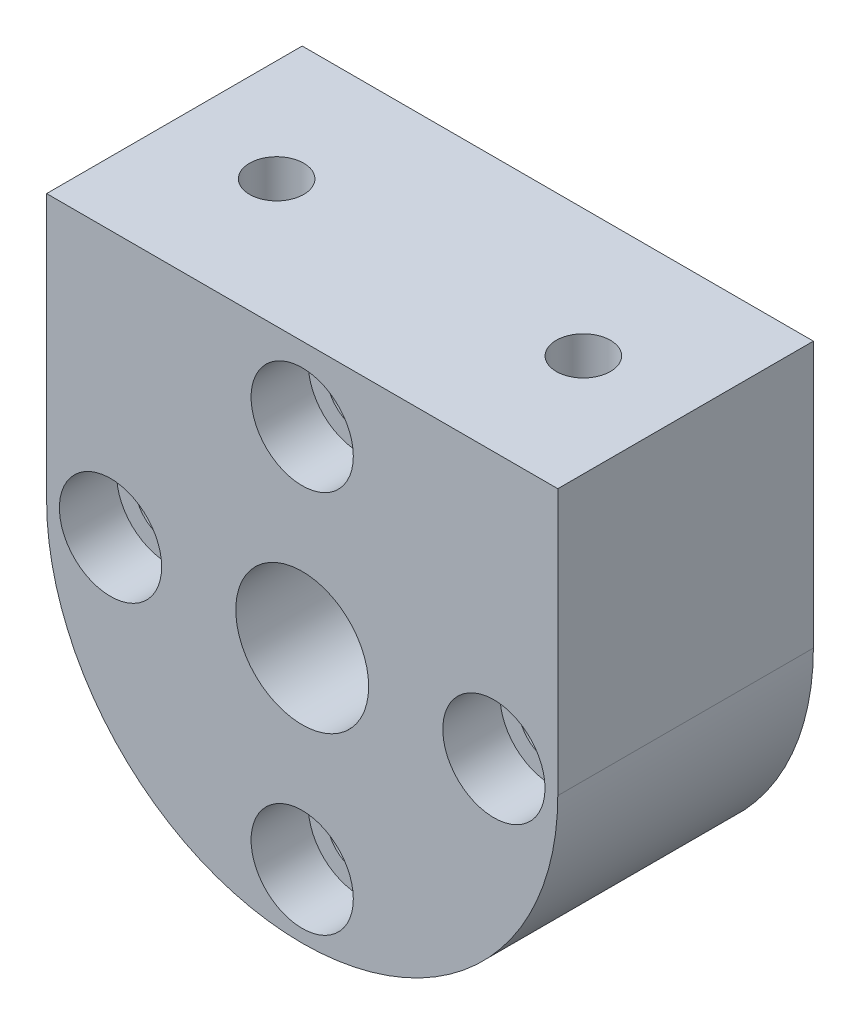
ISO-10303-21;
HEADER;
FILE_DESCRIPTION(('STEP AP214'),'2;1');
FILE_NAME('part.step','',(''),(''),'','','');
FILE_SCHEMA(('AUTOMOTIVE_DESIGN { 1 0 10303 214 1 1 1 1 }'));
ENDSEC;
DATA;
#1=APPLICATION_CONTEXT('core data for automotive mechanical design processes');
#2=APPLICATION_PROTOCOL_DEFINITION('international standard','automotive_design',2000,#1);
#3=PRODUCT_CONTEXT('',#1,'mechanical');
#4=PRODUCT('Part','Part','',(#3));
#5=PRODUCT_RELATED_PRODUCT_CATEGORY('part','',(#4));
#6=PRODUCT_DEFINITION_FORMATION('','',#4);
#7=PRODUCT_DEFINITION_CONTEXT('part definition',#1,'design');
#8=PRODUCT_DEFINITION('design','',#6,#7);
#9=PRODUCT_DEFINITION_SHAPE('','',#8);
#10=(LENGTH_UNIT() NAMED_UNIT(*) SI_UNIT(.MILLI.,.METRE.));
#11=(NAMED_UNIT(*) PLANE_ANGLE_UNIT() SI_UNIT($,.RADIAN.));
#12=(NAMED_UNIT(*) SI_UNIT($,.STERADIAN.) SOLID_ANGLE_UNIT());
#13=UNCERTAINTY_MEASURE_WITH_UNIT(LENGTH_MEASURE(1.E-05),#10,'distance_accuracy_value','');
#14=(GEOMETRIC_REPRESENTATION_CONTEXT(3) GLOBAL_UNCERTAINTY_ASSIGNED_CONTEXT((#13)) GLOBAL_UNIT_ASSIGNED_CONTEXT((#10,
#11,#12)) REPRESENTATION_CONTEXT('',''));
#15=CARTESIAN_POINT('',(0.,0.,0.));
#16=DIRECTION('',(0.,0.,1.));
#17=DIRECTION('',(1.,0.,0.));
#18=AXIS2_PLACEMENT_3D('',#15,#16,#17);
#19=CARTESIAN_POINT('',(0.,0.,12.7));
#20=DIRECTION('',(0.,0.,-1.));
#21=DIRECTION('',(-1.,0.,0.));
#22=AXIS2_PLACEMENT_3D('',#19,#20,#21);
#23=CYLINDRICAL_SURFACE('',#22,12.7);
#24=CARTESIAN_POINT('',(0.,0.,0.));
#25=DIRECTION('',(0.,0.,1.));
#26=DIRECTION('',(1.,0.,0.));
#27=AXIS2_PLACEMENT_3D('',#24,#25,#26);
#28=CIRCLE('',#27,12.7);
#29=CARTESIAN_POINT('',(-12.7,0.,0.));
#30=VERTEX_POINT('',#29);
#31=CARTESIAN_POINT('',(12.7,0.,0.));
#32=VERTEX_POINT('',#31);
#33=EDGE_CURVE('E112',#30,#32,#28,.T.);
#34=ORIENTED_EDGE('',*,*,#33,.T.);
#35=DIRECTION('',(0.,0.,-1.));
#36=VECTOR('',#35,1.);
#37=CARTESIAN_POINT('',(12.7,0.,12.7));
#38=LINE('',#37,#36);
#39=CARTESIAN_POINT('',(12.7,0.,12.7));
#40=VERTEX_POINT('',#39);
#41=EDGE_CURVE('E13',#40,#32,#38,.T.);
#42=ORIENTED_EDGE('',*,*,#41,.F.);
#43=CARTESIAN_POINT('',(0.,0.,12.7));
#44=DIRECTION('',(0.,0.,1.));
#45=DIRECTION('',(1.,0.,0.));
#46=AXIS2_PLACEMENT_3D('',#43,#44,#45);
#47=CIRCLE('',#46,12.7);
#48=CARTESIAN_POINT('',(-12.7,0.,12.7));
#49=VERTEX_POINT('',#48);
#50=EDGE_CURVE('E100',#49,#40,#47,.T.);
#51=ORIENTED_EDGE('',*,*,#50,.F.);
#52=DIRECTION('',(0.,0.,-1.));
#53=VECTOR('',#52,1.);
#54=CARTESIAN_POINT('',(-12.7,0.,12.7));
#55=LINE('',#54,#53);
#56=EDGE_CURVE('E108',#49,#30,#55,.T.);
#57=ORIENTED_EDGE('',*,*,#56,.T.);
#58=EDGE_LOOP('',(#34,#42,#51,#57));
#59=FACE_BOUND('',#58,.T.);
#60=ADVANCED_FACE('F49',(#59),#23,.T.);
#61=CARTESIAN_POINT('',(12.7,0.,12.7));
#62=DIRECTION('',(-1.,0.,0.));
#63=DIRECTION('',(0.,0.,1.));
#64=AXIS2_PLACEMENT_3D('',#61,#62,#63);
#65=PLANE('',#64);
#66=DIRECTION('',(0.,1.,0.));
#67=VECTOR('',#66,1.);
#68=CARTESIAN_POINT('',(12.7,0.,0.));
#69=LINE('',#68,#67);
#70=CARTESIAN_POINT('',(12.7,13.208,0.));
#71=VERTEX_POINT('',#70);
#72=EDGE_CURVE('E104',#32,#71,#69,.T.);
#73=ORIENTED_EDGE('',*,*,#72,.T.);
#74=DIRECTION('',(0.,0.,-1.));
#75=VECTOR('',#74,1.);
#76=CARTESIAN_POINT('',(12.7,13.208,12.7));
#77=LINE('',#76,#75);
#78=CARTESIAN_POINT('',(12.7,13.208,12.7));
#79=VERTEX_POINT('',#78);
#80=EDGE_CURVE('E57',#79,#71,#77,.T.);
#81=ORIENTED_EDGE('',*,*,#80,.F.);
#82=DIRECTION('',(0.,1.,0.));
#83=VECTOR('',#82,1.);
#84=CARTESIAN_POINT('',(12.7,0.,12.7));
#85=LINE('',#84,#83);
#86=EDGE_CURVE('E95',#40,#79,#85,.T.);
#87=ORIENTED_EDGE('',*,*,#86,.F.);
#88=ORIENTED_EDGE('',*,*,#41,.T.);
#89=EDGE_LOOP('',(#73,#81,#87,#88));
#90=FACE_BOUND('',#89,.T.);
#91=ADVANCED_FACE('F103',(#90),#65,.F.);
#92=CARTESIAN_POINT('',(-12.7,13.208,12.7));
#93=DIRECTION('',(0.,-1.,0.));
#94=DIRECTION('',(0.,0.,-1.));
#95=AXIS2_PLACEMENT_3D('',#92,#93,#94);
#96=PLANE('',#95);
#97=CARTESIAN_POINT('',(7.62,13.208,6.34999999999999));
#98=DIRECTION('',(0.,1.,0.));
#99=DIRECTION('',(-1.,0.,0.));
#100=AXIS2_PLACEMENT_3D('',#97,#98,#99);
#101=CIRCLE('',#100,1.3462);
#102=CARTESIAN_POINT('',(6.2738,13.208,6.34999999999999));
#103=VERTEX_POINT('',#102);
#104=EDGE_CURVE('E186',#103,#103,#101,.T.);
#105=ORIENTED_EDGE('',*,*,#104,.F.);
#106=EDGE_LOOP('',(#105));
#107=FACE_BOUND('',#106,.T.);
#108=CARTESIAN_POINT('',(-7.62,13.208,6.35));
#109=DIRECTION('',(0.,1.,0.));
#110=DIRECTION('',(-1.,0.,0.));
#111=AXIS2_PLACEMENT_3D('',#108,#109,#110);
#112=CIRCLE('',#111,1.3462);
#113=CARTESIAN_POINT('',(-8.9662,13.208,6.35));
#114=VERTEX_POINT('',#113);
#115=EDGE_CURVE('E180',#114,#114,#112,.T.);
#116=ORIENTED_EDGE('',*,*,#115,.F.);
#117=EDGE_LOOP('',(#116));
#118=FACE_BOUND('',#117,.T.);
#119=DIRECTION('',(-1.,0.,0.));
#120=VECTOR('',#119,1.);
#121=CARTESIAN_POINT('',(-12.7,13.208,0.));
#122=LINE('',#121,#120);
#123=CARTESIAN_POINT('',(-12.7,13.208,0.));
#124=VERTEX_POINT('',#123);
#125=EDGE_CURVE('E82',#71,#124,#122,.T.);
#126=ORIENTED_EDGE('',*,*,#125,.T.);
#127=DIRECTION('',(0.,0.,-1.));
#128=VECTOR('',#127,1.);
#129=CARTESIAN_POINT('',(-12.7,13.208,12.7));
#130=LINE('',#129,#128);
#131=CARTESIAN_POINT('',(-12.7,13.208,12.7));
#132=VERTEX_POINT('',#131);
#133=EDGE_CURVE('E105',#132,#124,#130,.T.);
#134=ORIENTED_EDGE('',*,*,#133,.F.);
#135=DIRECTION('',(-1.,0.,0.));
#136=VECTOR('',#135,1.);
#137=CARTESIAN_POINT('',(-12.7,13.208,12.7));
#138=LINE('',#137,#136);
#139=EDGE_CURVE('E98',#79,#132,#138,.T.);
#140=ORIENTED_EDGE('',*,*,#139,.F.);
#141=ORIENTED_EDGE('',*,*,#80,.T.);
#142=EDGE_LOOP('',(#126,#134,#140,#141));
#143=FACE_BOUND('',#142,.T.);
#144=ADVANCED_FACE('F106',(#107,#118,#143),#96,.F.);
#145=CARTESIAN_POINT('',(-12.7,0.,12.7));
#146=DIRECTION('',(1.,0.,0.));
#147=DIRECTION('',(0.,0.,-1.));
#148=AXIS2_PLACEMENT_3D('',#145,#146,#147);
#149=PLANE('',#148);
#150=DIRECTION('',(0.,-1.,0.));
#151=VECTOR('',#150,1.);
#152=CARTESIAN_POINT('',(-12.7,0.,0.));
#153=LINE('',#152,#151);
#154=EDGE_CURVE('E88',#124,#30,#153,.T.);
#155=ORIENTED_EDGE('',*,*,#154,.T.);
#156=ORIENTED_EDGE('',*,*,#56,.F.);
#157=DIRECTION('',(0.,-1.,0.));
#158=VECTOR('',#157,1.);
#159=CARTESIAN_POINT('',(-12.7,0.,12.7));
#160=LINE('',#159,#158);
#161=EDGE_CURVE('E65',#132,#49,#160,.T.);
#162=ORIENTED_EDGE('',*,*,#161,.F.);
#163=ORIENTED_EDGE('',*,*,#133,.T.);
#164=EDGE_LOOP('',(#155,#156,#162,#163));
#165=FACE_BOUND('',#164,.T.);
#166=ADVANCED_FACE('F120',(#165),#149,.F.);
#167=CARTESIAN_POINT('',(0.,0.,12.7));
#168=DIRECTION('',(0.,0.,1.));
#169=DIRECTION('',(1.,0.,0.));
#170=AXIS2_PLACEMENT_3D('',#167,#168,#169);
#171=PLANE('',#170);
#172=CARTESIAN_POINT('',(0.,9.525,12.7));
#173=DIRECTION('',(0.,0.,1.));
#174=DIRECTION('',(1.,0.,0.));
#175=AXIS2_PLACEMENT_3D('',#172,#173,#174);
#176=CIRCLE('',#175,2.54);
#177=CARTESIAN_POINT('',(2.54,9.525,12.7));
#178=VERTEX_POINT('',#177);
#179=EDGE_CURVE('E176',#178,#178,#176,.T.);
#180=ORIENTED_EDGE('',*,*,#179,.F.);
#181=EDGE_LOOP('',(#180));
#182=FACE_BOUND('',#181,.T.);
#183=CARTESIAN_POINT('',(9.525,0.,12.7));
#184=DIRECTION('',(0.,0.,1.));
#185=DIRECTION('',(1.,0.,0.));
#186=AXIS2_PLACEMENT_3D('',#183,#184,#185);
#187=CIRCLE('',#186,2.54);
#188=CARTESIAN_POINT('',(12.065,0.,12.7));
#189=VERTEX_POINT('',#188);
#190=EDGE_CURVE('E164',#189,#189,#187,.T.);
#191=ORIENTED_EDGE('',*,*,#190,.F.);
#192=EDGE_LOOP('',(#191));
#193=FACE_BOUND('',#192,.T.);
#194=CARTESIAN_POINT('',(0.,-9.525,12.7));
#195=DIRECTION('',(0.,0.,1.));
#196=DIRECTION('',(1.,0.,0.));
#197=AXIS2_PLACEMENT_3D('',#194,#195,#196);
#198=CIRCLE('',#197,2.54);
#199=CARTESIAN_POINT('',(2.54,-9.525,12.7));
#200=VERTEX_POINT('',#199);
#201=EDGE_CURVE('E152',#200,#200,#198,.T.);
#202=ORIENTED_EDGE('',*,*,#201,.F.);
#203=EDGE_LOOP('',(#202));
#204=FACE_BOUND('',#203,.T.);
#205=CARTESIAN_POINT('',(-9.525,0.,12.7));
#206=DIRECTION('',(0.,0.,1.));
#207=DIRECTION('',(1.,0.,0.));
#208=AXIS2_PLACEMENT_3D('',#205,#206,#207);
#209=CIRCLE('',#208,2.54);
#210=CARTESIAN_POINT('',(-6.985,0.,12.7));
#211=VERTEX_POINT('',#210);
#212=EDGE_CURVE('E140',#211,#211,#209,.T.);
#213=ORIENTED_EDGE('',*,*,#212,.F.);
#214=EDGE_LOOP('',(#213));
#215=FACE_BOUND('',#214,.T.);
#216=CARTESIAN_POINT('',(0.,0.,12.7));
#217=DIRECTION('',(0.,0.,1.));
#218=DIRECTION('',(1.,0.,0.));
#219=AXIS2_PLACEMENT_3D('',#216,#217,#218);
#220=CIRCLE('',#219,3.302);
#221=CARTESIAN_POINT('',(3.302,0.,12.7));
#222=VERTEX_POINT('',#221);
#223=EDGE_CURVE('E126',#222,#222,#220,.T.);
#224=ORIENTED_EDGE('',*,*,#223,.F.);
#225=EDGE_LOOP('',(#224));
#226=FACE_BOUND('',#225,.T.);
#227=ORIENTED_EDGE('',*,*,#50,.T.);
#228=ORIENTED_EDGE('',*,*,#86,.T.);
#229=ORIENTED_EDGE('',*,*,#139,.T.);
#230=ORIENTED_EDGE('',*,*,#161,.T.);
#231=EDGE_LOOP('',(#227,#228,#229,#230));
#232=FACE_BOUND('',#231,.T.);
#233=ADVANCED_FACE('F96',(#182,#193,#204,#215,#226,#232),#171,.T.);
#234=CARTESIAN_POINT('',(0.,0.,0.));
#235=DIRECTION('',(0.,0.,1.));
#236=DIRECTION('',(1.,0.,0.));
#237=AXIS2_PLACEMENT_3D('',#234,#235,#236);
#238=PLANE('',#237);
#239=CARTESIAN_POINT('',(0.,9.525,0.));
#240=DIRECTION('',(0.,0.,1.));
#241=DIRECTION('',(1.,0.,0.));
#242=AXIS2_PLACEMENT_3D('',#239,#240,#241);
#243=CIRCLE('',#242,1.63195);
#244=CARTESIAN_POINT('',(1.63195,9.525,0.));
#245=VERTEX_POINT('',#244);
#246=EDGE_CURVE('E167',#245,#245,#243,.T.);
#247=ORIENTED_EDGE('',*,*,#246,.T.);
#248=EDGE_LOOP('',(#247));
#249=FACE_BOUND('',#248,.T.);
#250=CARTESIAN_POINT('',(9.525,0.,0.));
#251=DIRECTION('',(0.,0.,1.));
#252=DIRECTION('',(1.,0.,0.));
#253=AXIS2_PLACEMENT_3D('',#250,#251,#252);
#254=CIRCLE('',#253,1.63195);
#255=CARTESIAN_POINT('',(11.15695,0.,0.));
#256=VERTEX_POINT('',#255);
#257=EDGE_CURVE('E155',#256,#256,#254,.T.);
#258=ORIENTED_EDGE('',*,*,#257,.T.);
#259=EDGE_LOOP('',(#258));
#260=FACE_BOUND('',#259,.T.);
#261=CARTESIAN_POINT('',(0.,-9.525,0.));
#262=DIRECTION('',(0.,0.,1.));
#263=DIRECTION('',(1.,0.,0.));
#264=AXIS2_PLACEMENT_3D('',#261,#262,#263);
#265=CIRCLE('',#264,1.63195);
#266=CARTESIAN_POINT('',(1.63195,-9.525,0.));
#267=VERTEX_POINT('',#266);
#268=EDGE_CURVE('E143',#267,#267,#265,.T.);
#269=ORIENTED_EDGE('',*,*,#268,.T.);
#270=EDGE_LOOP('',(#269));
#271=FACE_BOUND('',#270,.T.);
#272=CARTESIAN_POINT('',(-9.525,0.,0.));
#273=DIRECTION('',(0.,0.,1.));
#274=DIRECTION('',(1.,0.,0.));
#275=AXIS2_PLACEMENT_3D('',#272,#273,#274);
#276=CIRCLE('',#275,1.63195);
#277=CARTESIAN_POINT('',(-7.89305,0.,0.));
#278=VERTEX_POINT('',#277);
#279=EDGE_CURVE('E129',#278,#278,#276,.T.);
#280=ORIENTED_EDGE('',*,*,#279,.T.);
#281=EDGE_LOOP('',(#280));
#282=FACE_BOUND('',#281,.T.);
#283=CARTESIAN_POINT('',(0.,0.,0.));
#284=DIRECTION('',(0.,0.,1.));
#285=DIRECTION('',(1.,0.,0.));
#286=AXIS2_PLACEMENT_3D('',#283,#284,#285);
#287=CIRCLE('',#286,3.302);
#288=CARTESIAN_POINT('',(3.302,0.,0.));
#289=VERTEX_POINT('',#288);
#290=EDGE_CURVE('E115',#289,#289,#287,.T.);
#291=ORIENTED_EDGE('',*,*,#290,.T.);
#292=EDGE_LOOP('',(#291));
#293=FACE_BOUND('',#292,.T.);
#294=ORIENTED_EDGE('',*,*,#33,.F.);
#295=ORIENTED_EDGE('',*,*,#154,.F.);
#296=ORIENTED_EDGE('',*,*,#125,.F.);
#297=ORIENTED_EDGE('',*,*,#72,.F.);
#298=EDGE_LOOP('',(#294,#295,#296,#297));
#299=FACE_BOUND('',#298,.T.);
#300=ADVANCED_FACE('F123',(#249,#260,#271,#282,#293,#299),#238,.F.);
#301=CARTESIAN_POINT('',(0.,0.,0.));
#302=DIRECTION('',(0.,0.,1.));
#303=DIRECTION('',(1.,0.,0.));
#304=AXIS2_PLACEMENT_3D('',#301,#302,#303);
#305=CYLINDRICAL_SURFACE('',#304,3.302);
#306=ORIENTED_EDGE('',*,*,#290,.F.);
#307=EDGE_LOOP('',(#306));
#308=FACE_BOUND('',#307,.T.);
#309=ORIENTED_EDGE('',*,*,#223,.T.);
#310=EDGE_LOOP('',(#309));
#311=FACE_BOUND('',#310,.T.);
#312=ADVANCED_FACE('F232',(#308,#311),#305,.F.);
#313=CARTESIAN_POINT('',(-9.525,0.,12.7));
#314=DIRECTION('',(0.,0.,1.));
#315=DIRECTION('',(1.,0.,0.));
#316=AXIS2_PLACEMENT_3D('',#313,#314,#315);
#317=CYLINDRICAL_SURFACE('',#316,1.63195);
#318=ORIENTED_EDGE('',*,*,#279,.F.);
#319=EDGE_LOOP('',(#318));
#320=FACE_BOUND('',#319,.T.);
#321=CARTESIAN_POINT('',(-9.525,0.,9.8552));
#322=DIRECTION('',(0.,0.,1.));
#323=DIRECTION('',(1.,0.,0.));
#324=AXIS2_PLACEMENT_3D('',#321,#322,#323);
#325=CIRCLE('',#324,1.63195);
#326=CARTESIAN_POINT('',(-7.89305,0.,9.8552));
#327=VERTEX_POINT('',#326);
#328=EDGE_CURVE('E134',#327,#327,#325,.T.);
#329=ORIENTED_EDGE('',*,*,#328,.T.);
#330=EDGE_LOOP('',(#329));
#331=FACE_BOUND('',#330,.T.);
#332=ADVANCED_FACE('F239',(#320,#331),#317,.F.);
#333=CARTESIAN_POINT('',(-7.89305,0.,9.8552));
#334=DIRECTION('',(0.,0.,-1.));
#335=DIRECTION('',(-1.,0.,0.));
#336=AXIS2_PLACEMENT_3D('',#333,#334,#335);
#337=PLANE('',#336);
#338=ORIENTED_EDGE('',*,*,#328,.F.);
#339=EDGE_LOOP('',(#338));
#340=FACE_BOUND('',#339,.T.);
#341=CARTESIAN_POINT('',(-9.525,0.,9.8552));
#342=DIRECTION('',(0.,0.,1.));
#343=DIRECTION('',(1.,0.,0.));
#344=AXIS2_PLACEMENT_3D('',#341,#342,#343);
#345=CIRCLE('',#344,2.54);
#346=CARTESIAN_POINT('',(-6.985,0.,9.8552));
#347=VERTEX_POINT('',#346);
#348=EDGE_CURVE('E137',#347,#347,#345,.T.);
#349=ORIENTED_EDGE('',*,*,#348,.T.);
#350=EDGE_LOOP('',(#349));
#351=FACE_BOUND('',#350,.T.);
#352=ADVANCED_FACE('F243',(#340,#351),#337,.F.);
#353=CARTESIAN_POINT('',(-9.525,0.,12.7));
#354=DIRECTION('',(0.,0.,1.));
#355=DIRECTION('',(1.,0.,0.));
#356=AXIS2_PLACEMENT_3D('',#353,#354,#355);
#357=CYLINDRICAL_SURFACE('',#356,2.54);
#358=ORIENTED_EDGE('',*,*,#348,.F.);
#359=EDGE_LOOP('',(#358));
#360=FACE_BOUND('',#359,.T.);
#361=ORIENTED_EDGE('',*,*,#212,.T.);
#362=EDGE_LOOP('',(#361));
#363=FACE_BOUND('',#362,.T.);
#364=ADVANCED_FACE('F247',(#360,#363),#357,.F.);
#365=CARTESIAN_POINT('',(0.,-9.525,12.7));
#366=DIRECTION('',(0.,0.,1.));
#367=DIRECTION('',(1.,0.,0.));
#368=AXIS2_PLACEMENT_3D('',#365,#366,#367);
#369=CYLINDRICAL_SURFACE('',#368,1.63195);
#370=ORIENTED_EDGE('',*,*,#268,.F.);
#371=EDGE_LOOP('',(#370));
#372=FACE_BOUND('',#371,.T.);
#373=CARTESIAN_POINT('',(0.,-9.525,9.8552));
#374=DIRECTION('',(0.,0.,1.));
#375=DIRECTION('',(1.,0.,0.));
#376=AXIS2_PLACEMENT_3D('',#373,#374,#375);
#377=CIRCLE('',#376,1.63195);
#378=CARTESIAN_POINT('',(1.63195,-9.525,9.8552));
#379=VERTEX_POINT('',#378);
#380=EDGE_CURVE('E146',#379,#379,#377,.T.);
#381=ORIENTED_EDGE('',*,*,#380,.T.);
#382=EDGE_LOOP('',(#381));
#383=FACE_BOUND('',#382,.T.);
#384=ADVANCED_FACE('F251',(#372,#383),#369,.F.);
#385=CARTESIAN_POINT('',(1.63195,-9.525,9.8552));
#386=DIRECTION('',(0.,0.,-1.));
#387=DIRECTION('',(-1.,0.,0.));
#388=AXIS2_PLACEMENT_3D('',#385,#386,#387);
#389=PLANE('',#388);
#390=ORIENTED_EDGE('',*,*,#380,.F.);
#391=EDGE_LOOP('',(#390));
#392=FACE_BOUND('',#391,.T.);
#393=CARTESIAN_POINT('',(0.,-9.525,9.8552));
#394=DIRECTION('',(0.,0.,1.));
#395=DIRECTION('',(1.,0.,0.));
#396=AXIS2_PLACEMENT_3D('',#393,#394,#395);
#397=CIRCLE('',#396,2.54);
#398=CARTESIAN_POINT('',(2.54,-9.525,9.8552));
#399=VERTEX_POINT('',#398);
#400=EDGE_CURVE('E149',#399,#399,#397,.T.);
#401=ORIENTED_EDGE('',*,*,#400,.T.);
#402=EDGE_LOOP('',(#401));
#403=FACE_BOUND('',#402,.T.);
#404=ADVANCED_FACE('F255',(#392,#403),#389,.F.);
#405=CARTESIAN_POINT('',(0.,-9.525,12.7));
#406=DIRECTION('',(0.,0.,1.));
#407=DIRECTION('',(1.,0.,0.));
#408=AXIS2_PLACEMENT_3D('',#405,#406,#407);
#409=CYLINDRICAL_SURFACE('',#408,2.54);
#410=ORIENTED_EDGE('',*,*,#400,.F.);
#411=EDGE_LOOP('',(#410));
#412=FACE_BOUND('',#411,.T.);
#413=ORIENTED_EDGE('',*,*,#201,.T.);
#414=EDGE_LOOP('',(#413));
#415=FACE_BOUND('',#414,.T.);
#416=ADVANCED_FACE('F259',(#412,#415),#409,.F.);
#417=CARTESIAN_POINT('',(9.525,0.,12.7));
#418=DIRECTION('',(0.,0.,1.));
#419=DIRECTION('',(1.,0.,0.));
#420=AXIS2_PLACEMENT_3D('',#417,#418,#419);
#421=CYLINDRICAL_SURFACE('',#420,1.63195);
#422=ORIENTED_EDGE('',*,*,#257,.F.);
#423=EDGE_LOOP('',(#422));
#424=FACE_BOUND('',#423,.T.);
#425=CARTESIAN_POINT('',(9.525,0.,9.8552));
#426=DIRECTION('',(0.,0.,1.));
#427=DIRECTION('',(1.,0.,0.));
#428=AXIS2_PLACEMENT_3D('',#425,#426,#427);
#429=CIRCLE('',#428,1.63195);
#430=CARTESIAN_POINT('',(11.15695,0.,9.8552));
#431=VERTEX_POINT('',#430);
#432=EDGE_CURVE('E158',#431,#431,#429,.T.);
#433=ORIENTED_EDGE('',*,*,#432,.T.);
#434=EDGE_LOOP('',(#433));
#435=FACE_BOUND('',#434,.T.);
#436=ADVANCED_FACE('F263',(#424,#435),#421,.F.);
#437=CARTESIAN_POINT('',(11.15695,0.,9.8552));
#438=DIRECTION('',(0.,0.,-1.));
#439=DIRECTION('',(-1.,0.,0.));
#440=AXIS2_PLACEMENT_3D('',#437,#438,#439);
#441=PLANE('',#440);
#442=ORIENTED_EDGE('',*,*,#432,.F.);
#443=EDGE_LOOP('',(#442));
#444=FACE_BOUND('',#443,.T.);
#445=CARTESIAN_POINT('',(9.525,0.,9.8552));
#446=DIRECTION('',(0.,0.,1.));
#447=DIRECTION('',(1.,0.,0.));
#448=AXIS2_PLACEMENT_3D('',#445,#446,#447);
#449=CIRCLE('',#448,2.54);
#450=CARTESIAN_POINT('',(12.065,0.,9.8552));
#451=VERTEX_POINT('',#450);
#452=EDGE_CURVE('E161',#451,#451,#449,.T.);
#453=ORIENTED_EDGE('',*,*,#452,.T.);
#454=EDGE_LOOP('',(#453));
#455=FACE_BOUND('',#454,.T.);
#456=ADVANCED_FACE('F267',(#444,#455),#441,.F.);
#457=CARTESIAN_POINT('',(9.525,0.,12.7));
#458=DIRECTION('',(0.,0.,1.));
#459=DIRECTION('',(1.,0.,0.));
#460=AXIS2_PLACEMENT_3D('',#457,#458,#459);
#461=CYLINDRICAL_SURFACE('',#460,2.54);
#462=ORIENTED_EDGE('',*,*,#452,.F.);
#463=EDGE_LOOP('',(#462));
#464=FACE_BOUND('',#463,.T.);
#465=ORIENTED_EDGE('',*,*,#190,.T.);
#466=EDGE_LOOP('',(#465));
#467=FACE_BOUND('',#466,.T.);
#468=ADVANCED_FACE('F271',(#464,#467),#461,.F.);
#469=CARTESIAN_POINT('',(0.,9.525,12.7));
#470=DIRECTION('',(0.,0.,1.));
#471=DIRECTION('',(1.,0.,0.));
#472=AXIS2_PLACEMENT_3D('',#469,#470,#471);
#473=CYLINDRICAL_SURFACE('',#472,1.63195);
#474=ORIENTED_EDGE('',*,*,#246,.F.);
#475=EDGE_LOOP('',(#474));
#476=FACE_BOUND('',#475,.T.);
#477=CARTESIAN_POINT('',(0.,9.525,9.8552));
#478=DIRECTION('',(0.,0.,1.));
#479=DIRECTION('',(1.,0.,0.));
#480=AXIS2_PLACEMENT_3D('',#477,#478,#479);
#481=CIRCLE('',#480,1.63195);
#482=CARTESIAN_POINT('',(1.63195,9.525,9.8552));
#483=VERTEX_POINT('',#482);
#484=EDGE_CURVE('E170',#483,#483,#481,.T.);
#485=ORIENTED_EDGE('',*,*,#484,.T.);
#486=EDGE_LOOP('',(#485));
#487=FACE_BOUND('',#486,.T.);
#488=ADVANCED_FACE('F275',(#476,#487),#473,.F.);
#489=CARTESIAN_POINT('',(1.63195,9.525,9.8552));
#490=DIRECTION('',(0.,0.,-1.));
#491=DIRECTION('',(-1.,0.,0.));
#492=AXIS2_PLACEMENT_3D('',#489,#490,#491);
#493=PLANE('',#492);
#494=ORIENTED_EDGE('',*,*,#484,.F.);
#495=EDGE_LOOP('',(#494));
#496=FACE_BOUND('',#495,.T.);
#497=CARTESIAN_POINT('',(0.,9.525,9.8552));
#498=DIRECTION('',(0.,0.,1.));
#499=DIRECTION('',(1.,0.,0.));
#500=AXIS2_PLACEMENT_3D('',#497,#498,#499);
#501=CIRCLE('',#500,2.54);
#502=CARTESIAN_POINT('',(2.54,9.525,9.8552));
#503=VERTEX_POINT('',#502);
#504=EDGE_CURVE('E173',#503,#503,#501,.T.);
#505=ORIENTED_EDGE('',*,*,#504,.T.);
#506=EDGE_LOOP('',(#505));
#507=FACE_BOUND('',#506,.T.);
#508=ADVANCED_FACE('F217',(#496,#507),#493,.F.);
#509=CARTESIAN_POINT('',(0.,9.525,12.7));
#510=DIRECTION('',(0.,0.,1.));
#511=DIRECTION('',(1.,0.,0.));
#512=AXIS2_PLACEMENT_3D('',#509,#510,#511);
#513=CYLINDRICAL_SURFACE('',#512,2.54);
#514=ORIENTED_EDGE('',*,*,#504,.F.);
#515=EDGE_LOOP('',(#514));
#516=FACE_BOUND('',#515,.T.);
#517=ORIENTED_EDGE('',*,*,#179,.T.);
#518=EDGE_LOOP('',(#517));
#519=FACE_BOUND('',#518,.T.);
#520=ADVANCED_FACE('F208',(#516,#519),#513,.F.);
#521=CARTESIAN_POINT('',(-7.62,4.318,6.35));
#522=DIRECTION('',(0.,1.,0.));
#523=DIRECTION('',(-1.,0.,0.));
#524=AXIS2_PLACEMENT_3D('',#521,#522,#523);
#525=CYLINDRICAL_SURFACE('',#524,1.3462);
#526=CARTESIAN_POINT('',(-7.62,4.318,6.35));
#527=DIRECTION('',(0.,1.,0.));
#528=DIRECTION('',(-1.,0.,0.));
#529=AXIS2_PLACEMENT_3D('',#526,#527,#528);
#530=CIRCLE('',#529,1.3462);
#531=CARTESIAN_POINT('',(-8.9662,4.318,6.35));
#532=VERTEX_POINT('',#531);
#533=EDGE_CURVE('E179',#532,#532,#530,.T.);
#534=ORIENTED_EDGE('',*,*,#533,.F.);
#535=EDGE_LOOP('',(#534));
#536=FACE_BOUND('',#535,.T.);
#537=ORIENTED_EDGE('',*,*,#115,.T.);
#538=EDGE_LOOP('',(#537));
#539=FACE_BOUND('',#538,.T.);
#540=ADVANCED_FACE('F206',(#536,#539),#525,.F.);
#541=CARTESIAN_POINT('',(-7.62,4.318,6.35));
#542=DIRECTION('',(0.,1.,0.));
#543=DIRECTION('',(-1.,0.,0.));
#544=AXIS2_PLACEMENT_3D('',#541,#542,#543);
#545=PLANE('',#544);
#546=ORIENTED_EDGE('',*,*,#533,.T.);
#547=EDGE_LOOP('',(#546));
#548=FACE_BOUND('',#547,.T.);
#549=ADVANCED_FACE('F197',(#548),#545,.T.);
#550=CARTESIAN_POINT('',(7.62,4.318,6.34999999999999));
#551=DIRECTION('',(0.,1.,0.));
#552=DIRECTION('',(-1.,0.,0.));
#553=AXIS2_PLACEMENT_3D('',#550,#551,#552);
#554=CYLINDRICAL_SURFACE('',#553,1.3462);
#555=CARTESIAN_POINT('',(7.62,4.318,6.34999999999999));
#556=DIRECTION('',(0.,1.,0.));
#557=DIRECTION('',(-1.,0.,0.));
#558=AXIS2_PLACEMENT_3D('',#555,#556,#557);
#559=CIRCLE('',#558,1.3462);
#560=CARTESIAN_POINT('',(6.2738,4.318,6.34999999999999));
#561=VERTEX_POINT('',#560);
#562=EDGE_CURVE('E183',#561,#561,#559,.T.);
#563=ORIENTED_EDGE('',*,*,#562,.F.);
#564=EDGE_LOOP('',(#563));
#565=FACE_BOUND('',#564,.T.);
#566=ORIENTED_EDGE('',*,*,#104,.T.);
#567=EDGE_LOOP('',(#566));
#568=FACE_BOUND('',#567,.T.);
#569=ADVANCED_FACE('F194',(#565,#568),#554,.F.);
#570=CARTESIAN_POINT('',(7.62,4.318,6.34999999999999));
#571=DIRECTION('',(0.,1.,0.));
#572=DIRECTION('',(-1.,0.,0.));
#573=AXIS2_PLACEMENT_3D('',#570,#571,#572);
#574=PLANE('',#573);
#575=ORIENTED_EDGE('',*,*,#562,.T.);
#576=EDGE_LOOP('',(#575));
#577=FACE_BOUND('',#576,.T.);
#578=ADVANCED_FACE('F192',(#577),#574,.T.);
#579=CLOSED_SHELL('',(#60,#91,#144,#166,#233,#300,#312,#332,#352,#364,#384,#404,#416,#436,#456,
#468,#488,#508,#520,#540,#549,#569,#578));
#580=MANIFOLD_SOLID_BREP('B2',#579);
#581=ADVANCED_BREP_SHAPE_REPRESENTATION('',(#18,#580),#14);
#582=SHAPE_DEFINITION_REPRESENTATION(#9,#581);
ENDSEC;
END-ISO-10303-21;
